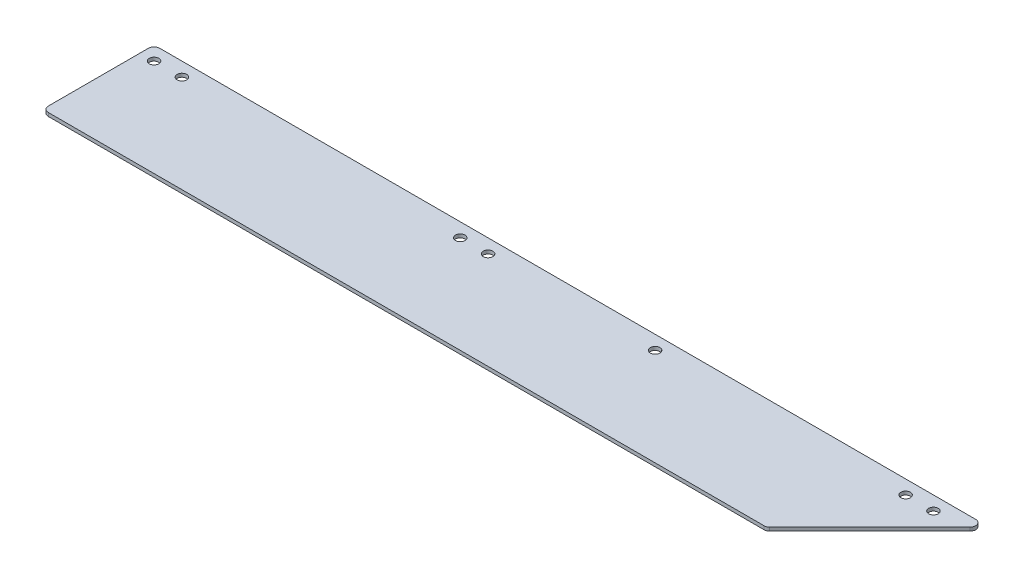
ISO-10303-21;
HEADER;
FILE_DESCRIPTION(('STEP AP214'),'2;1');
FILE_NAME('part.step','',(''),(''),'','','');
FILE_SCHEMA(('AUTOMOTIVE_DESIGN { 1 0 10303 214 1 1 1 1 }'));
ENDSEC;
DATA;
#1=APPLICATION_CONTEXT('core data for automotive mechanical design processes');
#2=APPLICATION_PROTOCOL_DEFINITION('international standard','automotive_design',2000,#1);
#3=PRODUCT_CONTEXT('',#1,'mechanical');
#4=PRODUCT('Part','Part','',(#3));
#5=PRODUCT_RELATED_PRODUCT_CATEGORY('part','',(#4));
#6=PRODUCT_DEFINITION_FORMATION('','',#4);
#7=PRODUCT_DEFINITION_CONTEXT('part definition',#1,'design');
#8=PRODUCT_DEFINITION('design','',#6,#7);
#9=PRODUCT_DEFINITION_SHAPE('','',#8);
#10=(LENGTH_UNIT() NAMED_UNIT(*) SI_UNIT(.MILLI.,.METRE.));
#11=(NAMED_UNIT(*) PLANE_ANGLE_UNIT() SI_UNIT($,.RADIAN.));
#12=(NAMED_UNIT(*) SI_UNIT($,.STERADIAN.) SOLID_ANGLE_UNIT());
#13=UNCERTAINTY_MEASURE_WITH_UNIT(LENGTH_MEASURE(1.E-05),#10,'distance_accuracy_value','');
#14=(GEOMETRIC_REPRESENTATION_CONTEXT(3) GLOBAL_UNCERTAINTY_ASSIGNED_CONTEXT((#13)) GLOBAL_UNIT_ASSIGNED_CONTEXT((#10,
#11,#12)) REPRESENTATION_CONTEXT('',''));
#15=CARTESIAN_POINT('',(0.,0.,0.));
#16=DIRECTION('',(0.,0.,1.));
#17=DIRECTION('',(1.,0.,0.));
#18=AXIS2_PLACEMENT_3D('',#15,#16,#17);
#19=CARTESIAN_POINT('',(374.867897551572,1.5875,2.54));
#20=DIRECTION('',(0.,1.,0.));
#21=DIRECTION('',(0.,0.,1.));
#22=AXIS2_PLACEMENT_3D('',#19,#20,#21);
#23=PLANE('',#22);
#24=CARTESIAN_POINT('',(361.95,1.5875,6.35));
#25=DIRECTION('',(0.,1.,0.));
#26=DIRECTION('',(0.,0.,1.));
#27=AXIS2_PLACEMENT_3D('',#24,#25,#26);
#28=CIRCLE('',#27,2.1828125);
#29=CARTESIAN_POINT('',(361.95,1.5875,8.5328125));
#30=VERTEX_POINT('',#29);
#31=EDGE_CURVE('E245',#30,#30,#28,.T.);
#32=ORIENTED_EDGE('',*,*,#31,.F.);
#33=EDGE_LOOP('',(#32));
#34=FACE_BOUND('',#33,.T.);
#35=CARTESIAN_POINT('',(158.75,1.5875,6.35));
#36=DIRECTION('',(0.,1.,0.));
#37=DIRECTION('',(0.,0.,1.));
#38=AXIS2_PLACEMENT_3D('',#35,#36,#37);
#39=CIRCLE('',#38,2.1828125);
#40=CARTESIAN_POINT('',(158.75,1.5875,8.5328125));
#41=VERTEX_POINT('',#40);
#42=EDGE_CURVE('E229',#41,#41,#39,.T.);
#43=ORIENTED_EDGE('',*,*,#42,.F.);
#44=EDGE_LOOP('',(#43));
#45=FACE_BOUND('',#44,.T.);
#46=CARTESIAN_POINT('',(19.05,1.5875,6.35));
#47=DIRECTION('',(0.,1.,0.));
#48=DIRECTION('',(0.,0.,1.));
#49=AXIS2_PLACEMENT_3D('',#46,#47,#48);
#50=CIRCLE('',#49,2.1828125);
#51=CARTESIAN_POINT('',(19.05,1.5875,8.5328125));
#52=VERTEX_POINT('',#51);
#53=EDGE_CURVE('E213',#52,#52,#50,.T.);
#54=ORIENTED_EDGE('',*,*,#53,.F.);
#55=EDGE_LOOP('',(#54));
#56=FACE_BOUND('',#55,.T.);
#57=CARTESIAN_POINT('',(374.867897551572,1.5875,2.54));
#58=DIRECTION('',(0.,1.,0.));
#59=DIRECTION('',(0.,0.,1.));
#60=AXIS2_PLACEMENT_3D('',#57,#58,#59);
#61=CIRCLE('',#60,2.54);
#62=CARTESIAN_POINT('',(376.663948775786,1.5875,4.33605122421384));
#63=VERTEX_POINT('',#62);
#64=CARTESIAN_POINT('',(374.867897551572,1.5875,0.));
#65=VERTEX_POINT('',#64);
#66=EDGE_CURVE('E164',#63,#65,#61,.T.);
#67=ORIENTED_EDGE('',*,*,#66,.T.);
#68=DIRECTION('',(-1.,0.,0.));
#69=VECTOR('',#68,1.);
#70=CARTESIAN_POINT('',(2.54000000000002,1.5875,0.));
#71=LINE('',#70,#69);
#72=CARTESIAN_POINT('',(2.54000000000002,1.5875,0.));
#73=VERTEX_POINT('',#72);
#74=EDGE_CURVE('E100',#65,#73,#71,.T.);
#75=ORIENTED_EDGE('',*,*,#74,.T.);
#76=CARTESIAN_POINT('',(2.54,1.5875,2.54));
#77=DIRECTION('',(0.,1.,0.));
#78=DIRECTION('',(0.,0.,1.));
#79=AXIS2_PLACEMENT_3D('',#76,#77,#78);
#80=CIRCLE('',#79,2.54);
#81=CARTESIAN_POINT('',(0.,1.5875,2.54000000000002));
#82=VERTEX_POINT('',#81);
#83=EDGE_CURVE('E185',#73,#82,#80,.T.);
#84=ORIENTED_EDGE('',*,*,#83,.T.);
#85=DIRECTION('',(0.,0.,1.));
#86=VECTOR('',#85,1.);
#87=CARTESIAN_POINT('',(0.,1.5875,48.26));
#88=LINE('',#87,#86);
#89=CARTESIAN_POINT('',(0.,1.5875,48.26));
#90=VERTEX_POINT('',#89);
#91=EDGE_CURVE('E199',#82,#90,#88,.T.);
#92=ORIENTED_EDGE('',*,*,#91,.T.);
#93=CARTESIAN_POINT('',(2.54,1.5875,48.26));
#94=DIRECTION('',(0.,1.,0.));
#95=DIRECTION('',(0.,0.,-1.));
#96=AXIS2_PLACEMENT_3D('',#93,#94,#95);
#97=CIRCLE('',#96,2.54);
#98=CARTESIAN_POINT('',(2.54000000000002,1.5875,50.8));
#99=VERTEX_POINT('',#98);
#100=EDGE_CURVE('E119',#90,#99,#97,.T.);
#101=ORIENTED_EDGE('',*,*,#100,.T.);
#102=DIRECTION('',(1.,0.,0.));
#103=VECTOR('',#102,1.);
#104=CARTESIAN_POINT('',(329.147897551572,1.5875,50.7999999999999));
#105=LINE('',#104,#103);
#106=CARTESIAN_POINT('',(329.147897551572,1.5875,50.7999999999999));
#107=VERTEX_POINT('',#106);
#108=EDGE_CURVE('E113',#99,#107,#105,.T.);
#109=ORIENTED_EDGE('',*,*,#108,.T.);
#110=CARTESIAN_POINT('',(329.147897551572,1.5875,48.26));
#111=DIRECTION('',(0.,1.,0.));
#112=DIRECTION('',(0.,0.,-1.));
#113=AXIS2_PLACEMENT_3D('',#110,#111,#112);
#114=CIRCLE('',#113,2.53999999999998);
#115=CARTESIAN_POINT('',(330.943948775786,1.5875,50.0560512242138));
#116=VERTEX_POINT('',#115);
#117=EDGE_CURVE('E117',#107,#116,#114,.T.);
#118=ORIENTED_EDGE('',*,*,#117,.T.);
#119=DIRECTION('',(0.707106781186548,0.,-0.707106781186547));
#120=VECTOR('',#119,1.);
#121=CARTESIAN_POINT('',(376.663948775786,1.5875,4.33605122421384));
#122=LINE('',#121,#120);
#123=EDGE_CURVE('E57',#116,#63,#122,.T.);
#124=ORIENTED_EDGE('',*,*,#123,.T.);
#125=EDGE_LOOP('',(#67,#75,#84,#92,#101,#109,#118,#124));
#126=FACE_BOUND('',#125,.T.);
#127=CARTESIAN_POINT('',(6.35,1.5875,6.35));
#128=DIRECTION('',(0.,1.,0.));
#129=DIRECTION('',(0.,0.,1.));
#130=AXIS2_PLACEMENT_3D('',#127,#128,#129);
#131=CIRCLE('',#130,2.1828125);
#132=CARTESIAN_POINT('',(6.35,1.5875,8.5328125));
#133=VERTEX_POINT('',#132);
#134=EDGE_CURVE('E146',#133,#133,#131,.T.);
#135=ORIENTED_EDGE('',*,*,#134,.F.);
#136=EDGE_LOOP('',(#135));
#137=FACE_BOUND('',#136,.T.);
#138=CARTESIAN_POINT('',(146.05,1.5875,6.35));
#139=DIRECTION('',(0.,1.,0.));
#140=DIRECTION('',(0.,0.,1.));
#141=AXIS2_PLACEMENT_3D('',#138,#139,#140);
#142=CIRCLE('',#141,2.1828125);
#143=CARTESIAN_POINT('',(146.05,1.5875,8.5328125));
#144=VERTEX_POINT('',#143);
#145=EDGE_CURVE('E221',#144,#144,#142,.T.);
#146=ORIENTED_EDGE('',*,*,#145,.F.);
#147=EDGE_LOOP('',(#146));
#148=FACE_BOUND('',#147,.T.);
#149=CARTESIAN_POINT('',(349.25,1.5875,6.35));
#150=DIRECTION('',(0.,1.,0.));
#151=DIRECTION('',(0.,0.,1.));
#152=AXIS2_PLACEMENT_3D('',#149,#150,#151);
#153=CIRCLE('',#152,2.1828125);
#154=CARTESIAN_POINT('',(349.25,1.5875,8.5328125));
#155=VERTEX_POINT('',#154);
#156=EDGE_CURVE('E237',#155,#155,#153,.T.);
#157=ORIENTED_EDGE('',*,*,#156,.F.);
#158=EDGE_LOOP('',(#157));
#159=FACE_BOUND('',#158,.T.);
#160=CARTESIAN_POINT('',(234.95,1.5875,6.35));
#161=DIRECTION('',(0.,1.,0.));
#162=DIRECTION('',(0.,0.,1.));
#163=AXIS2_PLACEMENT_3D('',#160,#161,#162);
#164=CIRCLE('',#163,2.1828125);
#165=CARTESIAN_POINT('',(234.95,1.5875,8.5328125));
#166=VERTEX_POINT('',#165);
#167=EDGE_CURVE('E253',#166,#166,#164,.T.);
#168=ORIENTED_EDGE('',*,*,#167,.F.);
#169=EDGE_LOOP('',(#168));
#170=FACE_BOUND('',#169,.T.);
#171=ADVANCED_FACE('F39',(#34,#45,#56,#126,#137,#148,#159,#170),#23,.T.);
#172=CARTESIAN_POINT('',(374.867897551572,0.,2.54));
#173=DIRECTION('',(0.,1.,0.));
#174=DIRECTION('',(0.,0.,1.));
#175=AXIS2_PLACEMENT_3D('',#172,#173,#174);
#176=PLANE('',#175);
#177=CARTESIAN_POINT('',(374.867897551572,0.,2.54));
#178=DIRECTION('',(0.,1.,0.));
#179=DIRECTION('',(0.,0.,1.));
#180=AXIS2_PLACEMENT_3D('',#177,#178,#179);
#181=CIRCLE('',#180,2.54);
#182=CARTESIAN_POINT('',(376.663948775786,0.,4.33605122421384));
#183=VERTEX_POINT('',#182);
#184=CARTESIAN_POINT('',(374.867897551572,0.,0.));
#185=VERTEX_POINT('',#184);
#186=EDGE_CURVE('E141',#183,#185,#181,.T.);
#187=ORIENTED_EDGE('',*,*,#186,.F.);
#188=DIRECTION('',(0.707106781186548,0.,-0.707106781186547));
#189=VECTOR('',#188,1.);
#190=CARTESIAN_POINT('',(376.663948775786,0.,4.33605122421384));
#191=LINE('',#190,#189);
#192=CARTESIAN_POINT('',(330.943948775786,0.,50.0560512242138));
#193=VERTEX_POINT('',#192);
#194=EDGE_CURVE('E92',#193,#183,#191,.T.);
#195=ORIENTED_EDGE('',*,*,#194,.F.);
#196=CARTESIAN_POINT('',(329.147897551572,0.,48.26));
#197=DIRECTION('',(0.,1.,0.));
#198=DIRECTION('',(0.,0.,-1.));
#199=AXIS2_PLACEMENT_3D('',#196,#197,#198);
#200=CIRCLE('',#199,2.53999999999998);
#201=CARTESIAN_POINT('',(329.147897551572,0.,50.7999999999999));
#202=VERTEX_POINT('',#201);
#203=EDGE_CURVE('E86',#202,#193,#200,.T.);
#204=ORIENTED_EDGE('',*,*,#203,.F.);
#205=DIRECTION('',(1.,0.,0.));
#206=VECTOR('',#205,1.);
#207=CARTESIAN_POINT('',(329.147897551572,0.,50.7999999999999));
#208=LINE('',#207,#206);
#209=CARTESIAN_POINT('',(2.54000000000002,0.,50.8));
#210=VERTEX_POINT('',#209);
#211=EDGE_CURVE('E128',#210,#202,#208,.T.);
#212=ORIENTED_EDGE('',*,*,#211,.F.);
#213=CARTESIAN_POINT('',(2.54,0.,48.26));
#214=DIRECTION('',(0.,1.,0.));
#215=DIRECTION('',(0.,0.,-1.));
#216=AXIS2_PLACEMENT_3D('',#213,#214,#215);
#217=CIRCLE('',#216,2.54);
#218=CARTESIAN_POINT('',(0.,0.,48.26));
#219=VERTEX_POINT('',#218);
#220=EDGE_CURVE('E155',#219,#210,#217,.T.);
#221=ORIENTED_EDGE('',*,*,#220,.F.);
#222=DIRECTION('',(0.,0.,1.));
#223=VECTOR('',#222,1.);
#224=CARTESIAN_POINT('',(0.,0.,48.26));
#225=LINE('',#224,#223);
#226=CARTESIAN_POINT('',(0.,0.,2.54000000000002));
#227=VERTEX_POINT('',#226);
#228=EDGE_CURVE('E152',#227,#219,#225,.T.);
#229=ORIENTED_EDGE('',*,*,#228,.F.);
#230=CARTESIAN_POINT('',(2.54,0.,2.54));
#231=DIRECTION('',(0.,1.,0.));
#232=DIRECTION('',(0.,0.,1.));
#233=AXIS2_PLACEMENT_3D('',#230,#231,#232);
#234=CIRCLE('',#233,2.54);
#235=CARTESIAN_POINT('',(2.54000000000002,0.,0.));
#236=VERTEX_POINT('',#235);
#237=EDGE_CURVE('E149',#236,#227,#234,.T.);
#238=ORIENTED_EDGE('',*,*,#237,.F.);
#239=DIRECTION('',(-1.,0.,0.));
#240=VECTOR('',#239,1.);
#241=CARTESIAN_POINT('',(2.54000000000002,0.,0.));
#242=LINE('',#241,#240);
#243=EDGE_CURVE('E145',#185,#236,#242,.T.);
#244=ORIENTED_EDGE('',*,*,#243,.F.);
#245=EDGE_LOOP('',(#187,#195,#204,#212,#221,#229,#238,#244));
#246=FACE_BOUND('',#245,.T.);
#247=CARTESIAN_POINT('',(6.35,0.,6.35));
#248=DIRECTION('',(0.,1.,0.));
#249=DIRECTION('',(0.,0.,1.));
#250=AXIS2_PLACEMENT_3D('',#247,#248,#249);
#251=CIRCLE('',#250,2.1828125);
#252=CARTESIAN_POINT('',(6.35,0.,8.5328125));
#253=VERTEX_POINT('',#252);
#254=EDGE_CURVE('E209',#253,#253,#251,.T.);
#255=ORIENTED_EDGE('',*,*,#254,.T.);
#256=EDGE_LOOP('',(#255));
#257=FACE_BOUND('',#256,.T.);
#258=CARTESIAN_POINT('',(19.05,0.,6.35));
#259=DIRECTION('',(0.,1.,0.));
#260=DIRECTION('',(0.,0.,1.));
#261=AXIS2_PLACEMENT_3D('',#258,#259,#260);
#262=CIRCLE('',#261,2.1828125);
#263=CARTESIAN_POINT('',(19.05,0.,8.5328125));
#264=VERTEX_POINT('',#263);
#265=EDGE_CURVE('E217',#264,#264,#262,.T.);
#266=ORIENTED_EDGE('',*,*,#265,.T.);
#267=EDGE_LOOP('',(#266));
#268=FACE_BOUND('',#267,.T.);
#269=CARTESIAN_POINT('',(146.05,0.,6.35));
#270=DIRECTION('',(0.,1.,0.));
#271=DIRECTION('',(0.,0.,1.));
#272=AXIS2_PLACEMENT_3D('',#269,#270,#271);
#273=CIRCLE('',#272,2.1828125);
#274=CARTESIAN_POINT('',(146.05,0.,8.5328125));
#275=VERTEX_POINT('',#274);
#276=EDGE_CURVE('E225',#275,#275,#273,.T.);
#277=ORIENTED_EDGE('',*,*,#276,.T.);
#278=EDGE_LOOP('',(#277));
#279=FACE_BOUND('',#278,.T.);
#280=CARTESIAN_POINT('',(158.75,0.,6.35));
#281=DIRECTION('',(0.,1.,0.));
#282=DIRECTION('',(0.,0.,1.));
#283=AXIS2_PLACEMENT_3D('',#280,#281,#282);
#284=CIRCLE('',#283,2.1828125);
#285=CARTESIAN_POINT('',(158.75,0.,8.5328125));
#286=VERTEX_POINT('',#285);
#287=EDGE_CURVE('E233',#286,#286,#284,.T.);
#288=ORIENTED_EDGE('',*,*,#287,.T.);
#289=EDGE_LOOP('',(#288));
#290=FACE_BOUND('',#289,.T.);
#291=CARTESIAN_POINT('',(349.25,0.,6.35));
#292=DIRECTION('',(0.,1.,0.));
#293=DIRECTION('',(0.,0.,1.));
#294=AXIS2_PLACEMENT_3D('',#291,#292,#293);
#295=CIRCLE('',#294,2.1828125);
#296=CARTESIAN_POINT('',(349.25,0.,8.5328125));
#297=VERTEX_POINT('',#296);
#298=EDGE_CURVE('E241',#297,#297,#295,.T.);
#299=ORIENTED_EDGE('',*,*,#298,.T.);
#300=EDGE_LOOP('',(#299));
#301=FACE_BOUND('',#300,.T.);
#302=CARTESIAN_POINT('',(361.95,0.,6.35));
#303=DIRECTION('',(0.,1.,0.));
#304=DIRECTION('',(0.,0.,1.));
#305=AXIS2_PLACEMENT_3D('',#302,#303,#304);
#306=CIRCLE('',#305,2.1828125);
#307=CARTESIAN_POINT('',(361.95,0.,8.5328125));
#308=VERTEX_POINT('',#307);
#309=EDGE_CURVE('E249',#308,#308,#306,.T.);
#310=ORIENTED_EDGE('',*,*,#309,.T.);
#311=EDGE_LOOP('',(#310));
#312=FACE_BOUND('',#311,.T.);
#313=CARTESIAN_POINT('',(234.95,0.,6.35));
#314=DIRECTION('',(0.,1.,0.));
#315=DIRECTION('',(0.,0.,1.));
#316=AXIS2_PLACEMENT_3D('',#313,#314,#315);
#317=CIRCLE('',#316,2.1828125);
#318=CARTESIAN_POINT('',(234.95,0.,8.5328125));
#319=VERTEX_POINT('',#318);
#320=EDGE_CURVE('E257',#319,#319,#317,.T.);
#321=ORIENTED_EDGE('',*,*,#320,.T.);
#322=EDGE_LOOP('',(#321));
#323=FACE_BOUND('',#322,.T.);
#324=ADVANCED_FACE('F189',(#246,#257,#268,#279,#290,#301,#312,#323),#176,.F.);
#325=CARTESIAN_POINT('',(374.867897551572,1.5875,2.54));
#326=DIRECTION('',(0.,-1.,0.));
#327=DIRECTION('',(0.,0.,-1.));
#328=AXIS2_PLACEMENT_3D('',#325,#326,#327);
#329=CYLINDRICAL_SURFACE('',#328,2.54);
#330=ORIENTED_EDGE('',*,*,#186,.T.);
#331=DIRECTION('',(0.,-1.,0.));
#332=VECTOR('',#331,1.);
#333=CARTESIAN_POINT('',(374.867897551572,1.5875,0.));
#334=LINE('',#333,#332);
#335=EDGE_CURVE('E11',#65,#185,#334,.T.);
#336=ORIENTED_EDGE('',*,*,#335,.F.);
#337=ORIENTED_EDGE('',*,*,#66,.F.);
#338=DIRECTION('',(0.,-1.,0.));
#339=VECTOR('',#338,1.);
#340=CARTESIAN_POINT('',(376.663948775786,1.5875,4.33605122421384));
#341=LINE('',#340,#339);
#342=EDGE_CURVE('E137',#63,#183,#341,.T.);
#343=ORIENTED_EDGE('',*,*,#342,.T.);
#344=EDGE_LOOP('',(#330,#336,#337,#343));
#345=FACE_BOUND('',#344,.T.);
#346=ADVANCED_FACE('F41',(#345),#329,.T.);
#347=CARTESIAN_POINT('',(2.54000000000002,1.5875,0.));
#348=DIRECTION('',(0.,0.,1.));
#349=DIRECTION('',(1.,0.,0.));
#350=AXIS2_PLACEMENT_3D('',#347,#348,#349);
#351=PLANE('',#350);
#352=ORIENTED_EDGE('',*,*,#243,.T.);
#353=DIRECTION('',(0.,-1.,0.));
#354=VECTOR('',#353,1.);
#355=CARTESIAN_POINT('',(2.54000000000002,1.5875,0.));
#356=LINE('',#355,#354);
#357=EDGE_CURVE('E49',#73,#236,#356,.T.);
#358=ORIENTED_EDGE('',*,*,#357,.F.);
#359=ORIENTED_EDGE('',*,*,#74,.F.);
#360=ORIENTED_EDGE('',*,*,#335,.T.);
#361=EDGE_LOOP('',(#352,#358,#359,#360));
#362=FACE_BOUND('',#361,.T.);
#363=ADVANCED_FACE('F293',(#362),#351,.F.);
#364=CARTESIAN_POINT('',(2.54,1.5875,2.54));
#365=DIRECTION('',(0.,-1.,0.));
#366=DIRECTION('',(0.,0.,-1.));
#367=AXIS2_PLACEMENT_3D('',#364,#365,#366);
#368=CYLINDRICAL_SURFACE('',#367,2.54);
#369=ORIENTED_EDGE('',*,*,#237,.T.);
#370=DIRECTION('',(0.,-1.,0.));
#371=VECTOR('',#370,1.);
#372=CARTESIAN_POINT('',(0.,1.5875,2.54000000000002));
#373=LINE('',#372,#371);
#374=EDGE_CURVE('E175',#82,#227,#373,.T.);
#375=ORIENTED_EDGE('',*,*,#374,.F.);
#376=ORIENTED_EDGE('',*,*,#83,.F.);
#377=ORIENTED_EDGE('',*,*,#357,.T.);
#378=EDGE_LOOP('',(#369,#375,#376,#377));
#379=FACE_BOUND('',#378,.T.);
#380=ADVANCED_FACE('F183',(#379),#368,.T.);
#381=CARTESIAN_POINT('',(0.,1.5875,48.26));
#382=DIRECTION('',(1.,0.,0.));
#383=DIRECTION('',(0.,0.,-1.));
#384=AXIS2_PLACEMENT_3D('',#381,#382,#383);
#385=PLANE('',#384);
#386=ORIENTED_EDGE('',*,*,#228,.T.);
#387=DIRECTION('',(0.,-1.,0.));
#388=VECTOR('',#387,1.);
#389=CARTESIAN_POINT('',(0.,1.5875,48.26));
#390=LINE('',#389,#388);
#391=EDGE_CURVE('E171',#90,#219,#390,.T.);
#392=ORIENTED_EDGE('',*,*,#391,.F.);
#393=ORIENTED_EDGE('',*,*,#91,.F.);
#394=ORIENTED_EDGE('',*,*,#374,.T.);
#395=EDGE_LOOP('',(#386,#392,#393,#394));
#396=FACE_BOUND('',#395,.T.);
#397=ADVANCED_FACE('F194',(#396),#385,.F.);
#398=CARTESIAN_POINT('',(2.54,1.5875,48.26));
#399=DIRECTION('',(0.,-1.,0.));
#400=DIRECTION('',(0.,0.,-1.));
#401=AXIS2_PLACEMENT_3D('',#398,#399,#400);
#402=CYLINDRICAL_SURFACE('',#401,2.54);
#403=ORIENTED_EDGE('',*,*,#220,.T.);
#404=DIRECTION('',(0.,-1.,0.));
#405=VECTOR('',#404,1.);
#406=CARTESIAN_POINT('',(2.54000000000002,1.5875,50.8));
#407=LINE('',#406,#405);
#408=EDGE_CURVE('E130',#99,#210,#407,.T.);
#409=ORIENTED_EDGE('',*,*,#408,.F.);
#410=ORIENTED_EDGE('',*,*,#100,.F.);
#411=ORIENTED_EDGE('',*,*,#391,.T.);
#412=EDGE_LOOP('',(#403,#409,#410,#411));
#413=FACE_BOUND('',#412,.T.);
#414=ADVANCED_FACE('F197',(#413),#402,.T.);
#415=CARTESIAN_POINT('',(329.147897551572,1.5875,50.7999999999999));
#416=DIRECTION('',(0.,0.,-1.));
#417=DIRECTION('',(-1.,0.,0.));
#418=AXIS2_PLACEMENT_3D('',#415,#416,#417);
#419=PLANE('',#418);
#420=ORIENTED_EDGE('',*,*,#211,.T.);
#421=DIRECTION('',(0.,-1.,0.));
#422=VECTOR('',#421,1.);
#423=CARTESIAN_POINT('',(329.147897551572,1.5875,50.7999999999999));
#424=LINE('',#423,#422);
#425=EDGE_CURVE('E125',#107,#202,#424,.T.);
#426=ORIENTED_EDGE('',*,*,#425,.F.);
#427=ORIENTED_EDGE('',*,*,#108,.F.);
#428=ORIENTED_EDGE('',*,*,#408,.T.);
#429=EDGE_LOOP('',(#420,#426,#427,#428));
#430=FACE_BOUND('',#429,.T.);
#431=ADVANCED_FACE('F126',(#430),#419,.F.);
#432=CARTESIAN_POINT('',(329.147897551572,1.5875,48.26));
#433=DIRECTION('',(0.,-1.,0.));
#434=DIRECTION('',(0.,0.,-1.));
#435=AXIS2_PLACEMENT_3D('',#432,#433,#434);
#436=CYLINDRICAL_SURFACE('',#435,2.53999999999998);
#437=ORIENTED_EDGE('',*,*,#203,.T.);
#438=DIRECTION('',(0.,-1.,0.));
#439=VECTOR('',#438,1.);
#440=CARTESIAN_POINT('',(330.943948775786,1.5875,50.0560512242138));
#441=LINE('',#440,#439);
#442=EDGE_CURVE('E131',#116,#193,#441,.T.);
#443=ORIENTED_EDGE('',*,*,#442,.F.);
#444=ORIENTED_EDGE('',*,*,#117,.F.);
#445=ORIENTED_EDGE('',*,*,#425,.T.);
#446=EDGE_LOOP('',(#437,#443,#444,#445));
#447=FACE_BOUND('',#446,.T.);
#448=ADVANCED_FACE('F133',(#447),#436,.T.);
#449=CARTESIAN_POINT('',(376.663948775786,1.5875,4.33605122421384));
#450=DIRECTION('',(-0.707106781186547,0.,-0.707106781186548));
#451=DIRECTION('',(-0.707106781186548,0.,0.707106781186547));
#452=AXIS2_PLACEMENT_3D('',#449,#450,#451);
#453=PLANE('',#452);
#454=ORIENTED_EDGE('',*,*,#194,.T.);
#455=ORIENTED_EDGE('',*,*,#342,.F.);
#456=ORIENTED_EDGE('',*,*,#123,.F.);
#457=ORIENTED_EDGE('',*,*,#442,.T.);
#458=EDGE_LOOP('',(#454,#455,#456,#457));
#459=FACE_BOUND('',#458,.T.);
#460=ADVANCED_FACE('F281',(#459),#453,.F.);
#461=CARTESIAN_POINT('',(6.35,1.5875,6.35));
#462=DIRECTION('',(0.,-1.,0.));
#463=DIRECTION('',(0.,0.,-1.));
#464=AXIS2_PLACEMENT_3D('',#461,#462,#463);
#465=CYLINDRICAL_SURFACE('',#464,2.1828125);
#466=ORIENTED_EDGE('',*,*,#134,.T.);
#467=EDGE_LOOP('',(#466));
#468=FACE_BOUND('',#467,.T.);
#469=ORIENTED_EDGE('',*,*,#254,.F.);
#470=EDGE_LOOP('',(#469));
#471=FACE_BOUND('',#470,.T.);
#472=ADVANCED_FACE('F278',(#468,#471),#465,.F.);
#473=CARTESIAN_POINT('',(19.05,1.5875,6.35));
#474=DIRECTION('',(0.,-1.,0.));
#475=DIRECTION('',(0.,0.,-1.));
#476=AXIS2_PLACEMENT_3D('',#473,#474,#475);
#477=CYLINDRICAL_SURFACE('',#476,2.1828125);
#478=ORIENTED_EDGE('',*,*,#53,.T.);
#479=EDGE_LOOP('',(#478));
#480=FACE_BOUND('',#479,.T.);
#481=ORIENTED_EDGE('',*,*,#265,.F.);
#482=EDGE_LOOP('',(#481));
#483=FACE_BOUND('',#482,.T.);
#484=ADVANCED_FACE('F357',(#480,#483),#477,.F.);
#485=CARTESIAN_POINT('',(146.05,1.5875,6.35));
#486=DIRECTION('',(0.,-1.,0.));
#487=DIRECTION('',(0.,0.,-1.));
#488=AXIS2_PLACEMENT_3D('',#485,#486,#487);
#489=CYLINDRICAL_SURFACE('',#488,2.1828125);
#490=ORIENTED_EDGE('',*,*,#145,.T.);
#491=EDGE_LOOP('',(#490));
#492=FACE_BOUND('',#491,.T.);
#493=ORIENTED_EDGE('',*,*,#276,.F.);
#494=EDGE_LOOP('',(#493));
#495=FACE_BOUND('',#494,.T.);
#496=ADVANCED_FACE('F365',(#492,#495),#489,.F.);
#497=CARTESIAN_POINT('',(158.75,1.5875,6.35));
#498=DIRECTION('',(0.,-1.,0.));
#499=DIRECTION('',(0.,0.,-1.));
#500=AXIS2_PLACEMENT_3D('',#497,#498,#499);
#501=CYLINDRICAL_SURFACE('',#500,2.1828125);
#502=ORIENTED_EDGE('',*,*,#42,.T.);
#503=EDGE_LOOP('',(#502));
#504=FACE_BOUND('',#503,.T.);
#505=ORIENTED_EDGE('',*,*,#287,.F.);
#506=EDGE_LOOP('',(#505));
#507=FACE_BOUND('',#506,.T.);
#508=ADVANCED_FACE('F373',(#504,#507),#501,.F.);
#509=CARTESIAN_POINT('',(349.25,1.5875,6.35));
#510=DIRECTION('',(0.,-1.,0.));
#511=DIRECTION('',(0.,0.,-1.));
#512=AXIS2_PLACEMENT_3D('',#509,#510,#511);
#513=CYLINDRICAL_SURFACE('',#512,2.1828125);
#514=ORIENTED_EDGE('',*,*,#156,.T.);
#515=EDGE_LOOP('',(#514));
#516=FACE_BOUND('',#515,.T.);
#517=ORIENTED_EDGE('',*,*,#298,.F.);
#518=EDGE_LOOP('',(#517));
#519=FACE_BOUND('',#518,.T.);
#520=ADVANCED_FACE('F382',(#516,#519),#513,.F.);
#521=CARTESIAN_POINT('',(361.95,1.5875,6.35));
#522=DIRECTION('',(0.,-1.,0.));
#523=DIRECTION('',(0.,0.,-1.));
#524=AXIS2_PLACEMENT_3D('',#521,#522,#523);
#525=CYLINDRICAL_SURFACE('',#524,2.1828125);
#526=ORIENTED_EDGE('',*,*,#31,.T.);
#527=EDGE_LOOP('',(#526));
#528=FACE_BOUND('',#527,.T.);
#529=ORIENTED_EDGE('',*,*,#309,.F.);
#530=EDGE_LOOP('',(#529));
#531=FACE_BOUND('',#530,.T.);
#532=ADVANCED_FACE('F391',(#528,#531),#525,.F.);
#533=CARTESIAN_POINT('',(234.95,1.5875,6.35));
#534=DIRECTION('',(0.,-1.,0.));
#535=DIRECTION('',(0.,0.,-1.));
#536=AXIS2_PLACEMENT_3D('',#533,#534,#535);
#537=CYLINDRICAL_SURFACE('',#536,2.1828125);
#538=ORIENTED_EDGE('',*,*,#167,.T.);
#539=EDGE_LOOP('',(#538));
#540=FACE_BOUND('',#539,.T.);
#541=ORIENTED_EDGE('',*,*,#320,.F.);
#542=EDGE_LOOP('',(#541));
#543=FACE_BOUND('',#542,.T.);
#544=ADVANCED_FACE('F265',(#540,#543),#537,.F.);
#545=CLOSED_SHELL('',(#171,#324,#346,#363,#380,#397,#414,#431,#448,#460,#472,#484,#496,#508,
#520,#532,#544));
#546=MANIFOLD_SOLID_BREP('B2',#545);
#547=ADVANCED_BREP_SHAPE_REPRESENTATION('',(#18,#546),#14);
#548=SHAPE_DEFINITION_REPRESENTATION(#9,#547);
ENDSEC;
END-ISO-10303-21;
